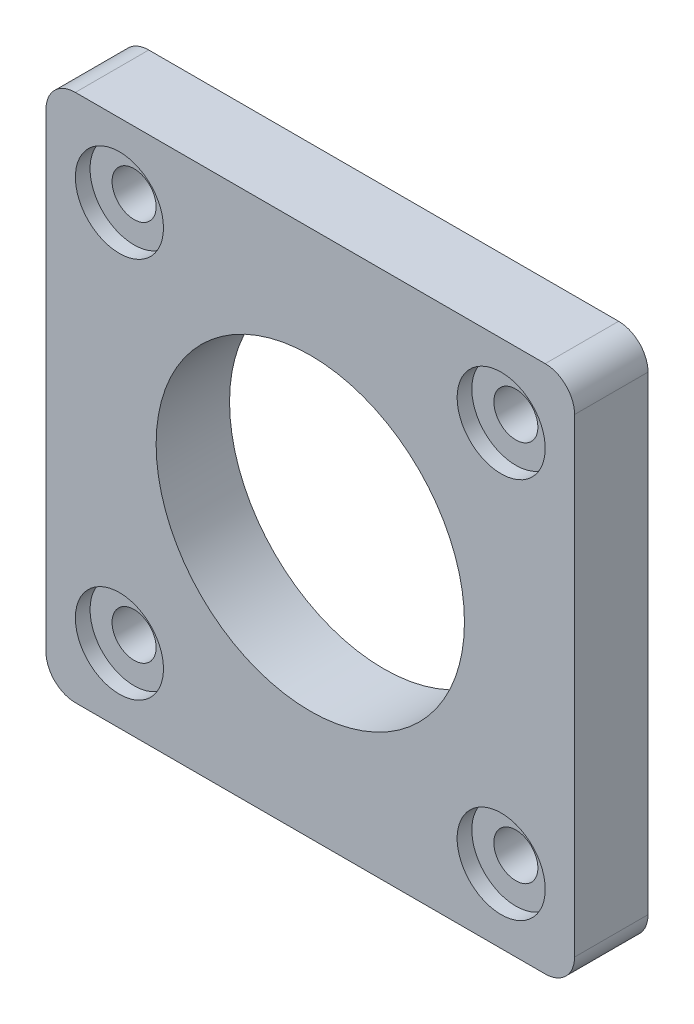
ISO-10303-21;
HEADER;
FILE_DESCRIPTION(('STEP AP214'),'2;1');
FILE_NAME('part.step','',(''),(''),'','','');
FILE_SCHEMA(('AUTOMOTIVE_DESIGN { 1 0 10303 214 1 1 1 1 }'));
ENDSEC;
DATA;
#1=APPLICATION_CONTEXT('core data for automotive mechanical design processes');
#2=APPLICATION_PROTOCOL_DEFINITION('international standard','automotive_design',2000,#1);
#3=PRODUCT_CONTEXT('',#1,'mechanical');
#4=PRODUCT('Part','Part','',(#3));
#5=PRODUCT_RELATED_PRODUCT_CATEGORY('part','',(#4));
#6=PRODUCT_DEFINITION_FORMATION('','',#4);
#7=PRODUCT_DEFINITION_CONTEXT('part definition',#1,'design');
#8=PRODUCT_DEFINITION('design','',#6,#7);
#9=PRODUCT_DEFINITION_SHAPE('','',#8);
#10=(LENGTH_UNIT() NAMED_UNIT(*) SI_UNIT(.MILLI.,.METRE.));
#11=(NAMED_UNIT(*) PLANE_ANGLE_UNIT() SI_UNIT($,.RADIAN.));
#12=(NAMED_UNIT(*) SI_UNIT($,.STERADIAN.) SOLID_ANGLE_UNIT());
#13=UNCERTAINTY_MEASURE_WITH_UNIT(LENGTH_MEASURE(1.E-05),#10,'distance_accuracy_value','');
#14=(GEOMETRIC_REPRESENTATION_CONTEXT(3) GLOBAL_UNCERTAINTY_ASSIGNED_CONTEXT((#13)) GLOBAL_UNIT_ASSIGNED_CONTEXT((#10,
#11,#12)) REPRESENTATION_CONTEXT('',''));
#15=CARTESIAN_POINT('',(0.,0.,0.));
#16=DIRECTION('',(0.,0.,1.));
#17=DIRECTION('',(1.,0.,0.));
#18=AXIS2_PLACEMENT_3D('',#15,#16,#17);
#19=CARTESIAN_POINT('',(-160.,160.,50.));
#20=DIRECTION('',(0.,0.,1.));
#21=DIRECTION('',(1.,0.,0.));
#22=AXIS2_PLACEMENT_3D('',#19,#20,#21);
#23=PLANE('',#22);
#24=CARTESIAN_POINT('',(130.,130.,50.));
#25=DIRECTION('',(0.,0.,-1.));
#26=DIRECTION('',(-1.,0.,0.));
#27=AXIS2_PLACEMENT_3D('',#24,#25,#26);
#28=CIRCLE('',#27,30.);
#29=CARTESIAN_POINT('',(100.,130.,50.));
#30=VERTEX_POINT('',#29);
#31=EDGE_CURVE('E351',#30,#30,#28,.T.);
#32=ORIENTED_EDGE('',*,*,#31,.T.);
#33=EDGE_LOOP('',(#32));
#34=FACE_BOUND('',#33,.T.);
#35=CARTESIAN_POINT('',(-130.,130.,50.));
#36=DIRECTION('',(0.,0.,1.));
#37=DIRECTION('',(1.,0.,0.));
#38=AXIS2_PLACEMENT_3D('',#35,#36,#37);
#39=CIRCLE('',#38,30.);
#40=CARTESIAN_POINT('',(-100.,130.,50.));
#41=VERTEX_POINT('',#40);
#42=EDGE_CURVE('E348',#41,#41,#39,.T.);
#43=ORIENTED_EDGE('',*,*,#42,.F.);
#44=EDGE_LOOP('',(#43));
#45=FACE_BOUND('',#44,.T.);
#46=CARTESIAN_POINT('',(0.,0.,50.));
#47=DIRECTION('',(0.,0.,1.));
#48=DIRECTION('',(1.,0.,0.));
#49=AXIS2_PLACEMENT_3D('',#46,#47,#48);
#50=CIRCLE('',#49,105.);
#51=CARTESIAN_POINT('',(105.,0.,50.));
#52=VERTEX_POINT('',#51);
#53=EDGE_CURVE('E221',#52,#52,#50,.T.);
#54=ORIENTED_EDGE('',*,*,#53,.F.);
#55=EDGE_LOOP('',(#54));
#56=FACE_BOUND('',#55,.T.);
#57=CARTESIAN_POINT('',(-160.,160.,50.));
#58=DIRECTION('',(0.,0.,1.));
#59=DIRECTION('',(1.,0.,0.));
#60=AXIS2_PLACEMENT_3D('',#57,#58,#59);
#61=CIRCLE('',#60,20.);
#62=CARTESIAN_POINT('',(-160.,180.,50.));
#63=VERTEX_POINT('',#62);
#64=CARTESIAN_POINT('',(-180.,160.,50.));
#65=VERTEX_POINT('',#64);
#66=EDGE_CURVE('E170',#63,#65,#61,.T.);
#67=ORIENTED_EDGE('',*,*,#66,.T.);
#68=DIRECTION('',(0.,-1.,0.));
#69=VECTOR('',#68,1.);
#70=CARTESIAN_POINT('',(-180.,160.,50.));
#71=LINE('',#70,#69);
#72=CARTESIAN_POINT('',(-180.,-160.,50.));
#73=VERTEX_POINT('',#72);
#74=EDGE_CURVE('E97',#65,#73,#71,.T.);
#75=ORIENTED_EDGE('',*,*,#74,.T.);
#76=CARTESIAN_POINT('',(-160.,-160.,50.));
#77=DIRECTION('',(0.,0.,1.));
#78=DIRECTION('',(1.,0.,0.));
#79=AXIS2_PLACEMENT_3D('',#76,#77,#78);
#80=CIRCLE('',#79,20.);
#81=CARTESIAN_POINT('',(-160.,-180.,50.));
#82=VERTEX_POINT('',#81);
#83=EDGE_CURVE('E232',#73,#82,#80,.T.);
#84=ORIENTED_EDGE('',*,*,#83,.T.);
#85=DIRECTION('',(1.,0.,0.));
#86=VECTOR('',#85,1.);
#87=CARTESIAN_POINT('',(-160.,-180.,50.));
#88=LINE('',#87,#86);
#89=CARTESIAN_POINT('',(160.,-180.,50.));
#90=VERTEX_POINT('',#89);
#91=EDGE_CURVE('E235',#82,#90,#88,.T.);
#92=ORIENTED_EDGE('',*,*,#91,.T.);
#93=CARTESIAN_POINT('',(160.,-160.,50.));
#94=DIRECTION('',(0.,0.,-1.));
#95=DIRECTION('',(-1.,0.,0.));
#96=AXIS2_PLACEMENT_3D('',#93,#94,#95);
#97=CIRCLE('',#96,20.);
#98=CARTESIAN_POINT('',(180.,-160.,50.));
#99=VERTEX_POINT('',#98);
#100=EDGE_CURVE('E132',#99,#90,#97,.T.);
#101=ORIENTED_EDGE('',*,*,#100,.F.);
#102=DIRECTION('',(0.,-1.,0.));
#103=VECTOR('',#102,1.);
#104=CARTESIAN_POINT('',(180.,160.,50.));
#105=LINE('',#104,#103);
#106=CARTESIAN_POINT('',(180.,160.,50.));
#107=VERTEX_POINT('',#106);
#108=EDGE_CURVE('E116',#107,#99,#105,.T.);
#109=ORIENTED_EDGE('',*,*,#108,.F.);
#110=CARTESIAN_POINT('',(160.,160.,50.));
#111=DIRECTION('',(0.,0.,-1.));
#112=DIRECTION('',(-1.,0.,0.));
#113=AXIS2_PLACEMENT_3D('',#110,#111,#112);
#114=CIRCLE('',#113,20.);
#115=CARTESIAN_POINT('',(160.,180.,50.));
#116=VERTEX_POINT('',#115);
#117=EDGE_CURVE('E130',#116,#107,#114,.T.);
#118=ORIENTED_EDGE('',*,*,#117,.F.);
#119=DIRECTION('',(1.,0.,0.));
#120=VECTOR('',#119,1.);
#121=CARTESIAN_POINT('',(-160.,180.,50.));
#122=LINE('',#121,#120);
#123=EDGE_CURVE('E137',#63,#116,#122,.T.);
#124=ORIENTED_EDGE('',*,*,#123,.F.);
#125=EDGE_LOOP('',(#67,#75,#84,#92,#101,#109,#118,#124));
#126=FACE_BOUND('',#125,.T.);
#127=CARTESIAN_POINT('',(130.,-130.,50.));
#128=DIRECTION('',(0.,0.,1.));
#129=DIRECTION('',(1.,0.,0.));
#130=AXIS2_PLACEMENT_3D('',#127,#128,#129);
#131=CIRCLE('',#130,30.);
#132=CARTESIAN_POINT('',(160.,-130.,50.));
#133=VERTEX_POINT('',#132);
#134=EDGE_CURVE('E365',#133,#133,#131,.T.);
#135=ORIENTED_EDGE('',*,*,#134,.F.);
#136=EDGE_LOOP('',(#135));
#137=FACE_BOUND('',#136,.T.);
#138=CARTESIAN_POINT('',(-130.,-130.,50.));
#139=DIRECTION('',(0.,0.,-1.));
#140=DIRECTION('',(-1.,0.,0.));
#141=AXIS2_PLACEMENT_3D('',#138,#139,#140);
#142=CIRCLE('',#141,30.);
#143=CARTESIAN_POINT('',(-160.,-130.,50.));
#144=VERTEX_POINT('',#143);
#145=EDGE_CURVE('E337',#144,#144,#142,.T.);
#146=ORIENTED_EDGE('',*,*,#145,.T.);
#147=EDGE_LOOP('',(#146));
#148=FACE_BOUND('',#147,.T.);
#149=ADVANCED_FACE('F39',(#34,#45,#56,#126,#137,#148),#23,.T.);
#150=CARTESIAN_POINT('',(-130.,130.,0.));
#151=DIRECTION('',(0.,0.,1.));
#152=DIRECTION('',(1.,0.,0.));
#153=AXIS2_PLACEMENT_3D('',#150,#151,#152);
#154=CYLINDRICAL_SURFACE('',#153,15.);
#155=CARTESIAN_POINT('',(-130.,130.,0.));
#156=DIRECTION('',(0.,0.,1.));
#157=DIRECTION('',(1.,0.,0.));
#158=AXIS2_PLACEMENT_3D('',#155,#156,#157);
#159=CIRCLE('',#158,15.);
#160=CARTESIAN_POINT('',(-115.,130.,0.));
#161=VERTEX_POINT('',#160);
#162=EDGE_CURVE('E217',#161,#161,#159,.T.);
#163=ORIENTED_EDGE('',*,*,#162,.F.);
#164=EDGE_LOOP('',(#163));
#165=FACE_BOUND('',#164,.T.);
#166=CARTESIAN_POINT('',(-130.,130.,40.));
#167=DIRECTION('',(0.,0.,1.));
#168=DIRECTION('',(1.,0.,0.));
#169=AXIS2_PLACEMENT_3D('',#166,#167,#168);
#170=CIRCLE('',#169,15.);
#171=CARTESIAN_POINT('',(-115.,130.,40.));
#172=VERTEX_POINT('',#171);
#173=EDGE_CURVE('E43',#172,#172,#170,.F.);
#174=ORIENTED_EDGE('',*,*,#173,.F.);
#175=EDGE_LOOP('',(#174));
#176=FACE_BOUND('',#175,.T.);
#177=ADVANCED_FACE('F260',(#165,#176),#154,.F.);
#178=CARTESIAN_POINT('',(130.,-130.,0.));
#179=DIRECTION('',(0.,0.,1.));
#180=DIRECTION('',(1.,0.,0.));
#181=AXIS2_PLACEMENT_3D('',#178,#179,#180);
#182=CYLINDRICAL_SURFACE('',#181,15.);
#183=CARTESIAN_POINT('',(130.,-130.,0.));
#184=DIRECTION('',(0.,0.,1.));
#185=DIRECTION('',(1.,0.,0.));
#186=AXIS2_PLACEMENT_3D('',#183,#184,#185);
#187=CIRCLE('',#186,15.);
#188=CARTESIAN_POINT('',(145.,-130.,0.));
#189=VERTEX_POINT('',#188);
#190=EDGE_CURVE('E207',#189,#189,#187,.T.);
#191=ORIENTED_EDGE('',*,*,#190,.F.);
#192=EDGE_LOOP('',(#191));
#193=FACE_BOUND('',#192,.T.);
#194=CARTESIAN_POINT('',(130.,-130.,40.));
#195=DIRECTION('',(0.,0.,1.));
#196=DIRECTION('',(1.,0.,0.));
#197=AXIS2_PLACEMENT_3D('',#194,#195,#196);
#198=CIRCLE('',#197,15.);
#199=CARTESIAN_POINT('',(145.,-130.,40.));
#200=VERTEX_POINT('',#199);
#201=EDGE_CURVE('E191',#200,#200,#198,.F.);
#202=ORIENTED_EDGE('',*,*,#201,.F.);
#203=EDGE_LOOP('',(#202));
#204=FACE_BOUND('',#203,.T.);
#205=ADVANCED_FACE('F266',(#193,#204),#182,.F.);
#206=CARTESIAN_POINT('',(-160.,160.,0.));
#207=DIRECTION('',(0.,0.,1.));
#208=DIRECTION('',(1.,0.,0.));
#209=AXIS2_PLACEMENT_3D('',#206,#207,#208);
#210=PLANE('',#209);
#211=ORIENTED_EDGE('',*,*,#190,.T.);
#212=EDGE_LOOP('',(#211));
#213=FACE_BOUND('',#212,.T.);
#214=ORIENTED_EDGE('',*,*,#162,.T.);
#215=EDGE_LOOP('',(#214));
#216=FACE_BOUND('',#215,.T.);
#217=CARTESIAN_POINT('',(0.,0.,0.));
#218=DIRECTION('',(0.,0.,1.));
#219=DIRECTION('',(1.,0.,0.));
#220=AXIS2_PLACEMENT_3D('',#217,#218,#219);
#221=CIRCLE('',#220,105.);
#222=CARTESIAN_POINT('',(105.,0.,0.));
#223=VERTEX_POINT('',#222);
#224=EDGE_CURVE('E147',#223,#223,#221,.T.);
#225=ORIENTED_EDGE('',*,*,#224,.T.);
#226=EDGE_LOOP('',(#225));
#227=FACE_BOUND('',#226,.T.);
#228=CARTESIAN_POINT('',(-160.,160.,0.));
#229=DIRECTION('',(0.,0.,1.));
#230=DIRECTION('',(1.,0.,0.));
#231=AXIS2_PLACEMENT_3D('',#228,#229,#230);
#232=CIRCLE('',#231,20.);
#233=CARTESIAN_POINT('',(-160.,180.,0.));
#234=VERTEX_POINT('',#233);
#235=CARTESIAN_POINT('',(-180.,160.,0.));
#236=VERTEX_POINT('',#235);
#237=EDGE_CURVE('E143',#234,#236,#232,.T.);
#238=ORIENTED_EDGE('',*,*,#237,.F.);
#239=DIRECTION('',(1.,0.,0.));
#240=VECTOR('',#239,1.);
#241=CARTESIAN_POINT('',(-160.,180.,0.));
#242=LINE('',#241,#240);
#243=CARTESIAN_POINT('',(160.,180.,0.));
#244=VERTEX_POINT('',#243);
#245=EDGE_CURVE('E166',#234,#244,#242,.T.);
#246=ORIENTED_EDGE('',*,*,#245,.T.);
#247=CARTESIAN_POINT('',(160.,160.,0.));
#248=DIRECTION('',(0.,0.,-1.));
#249=DIRECTION('',(-1.,0.,0.));
#250=AXIS2_PLACEMENT_3D('',#247,#248,#249);
#251=CIRCLE('',#250,20.);
#252=CARTESIAN_POINT('',(180.,160.,0.));
#253=VERTEX_POINT('',#252);
#254=EDGE_CURVE('E163',#244,#253,#251,.T.);
#255=ORIENTED_EDGE('',*,*,#254,.T.);
#256=DIRECTION('',(0.,-1.,0.));
#257=VECTOR('',#256,1.);
#258=CARTESIAN_POINT('',(180.,160.,0.));
#259=LINE('',#258,#257);
#260=CARTESIAN_POINT('',(180.,-160.,0.));
#261=VERTEX_POINT('',#260);
#262=EDGE_CURVE('E118',#253,#261,#259,.T.);
#263=ORIENTED_EDGE('',*,*,#262,.T.);
#264=CARTESIAN_POINT('',(160.,-160.,0.));
#265=DIRECTION('',(0.,0.,-1.));
#266=DIRECTION('',(-1.,0.,0.));
#267=AXIS2_PLACEMENT_3D('',#264,#265,#266);
#268=CIRCLE('',#267,20.);
#269=CARTESIAN_POINT('',(160.,-180.,0.));
#270=VERTEX_POINT('',#269);
#271=EDGE_CURVE('E157',#261,#270,#268,.T.);
#272=ORIENTED_EDGE('',*,*,#271,.T.);
#273=DIRECTION('',(1.,0.,0.));
#274=VECTOR('',#273,1.);
#275=CARTESIAN_POINT('',(-160.,-180.,0.));
#276=LINE('',#275,#274);
#277=CARTESIAN_POINT('',(-160.,-180.,0.));
#278=VERTEX_POINT('',#277);
#279=EDGE_CURVE('E153',#278,#270,#276,.T.);
#280=ORIENTED_EDGE('',*,*,#279,.F.);
#281=CARTESIAN_POINT('',(-160.,-160.,0.));
#282=DIRECTION('',(0.,0.,1.));
#283=DIRECTION('',(1.,0.,0.));
#284=AXIS2_PLACEMENT_3D('',#281,#282,#283);
#285=CIRCLE('',#284,20.);
#286=CARTESIAN_POINT('',(-180.,-160.,0.));
#287=VERTEX_POINT('',#286);
#288=EDGE_CURVE('E150',#287,#278,#285,.T.);
#289=ORIENTED_EDGE('',*,*,#288,.F.);
#290=DIRECTION('',(0.,-1.,0.));
#291=VECTOR('',#290,1.);
#292=CARTESIAN_POINT('',(-180.,160.,0.));
#293=LINE('',#292,#291);
#294=EDGE_CURVE('E146',#236,#287,#293,.T.);
#295=ORIENTED_EDGE('',*,*,#294,.F.);
#296=EDGE_LOOP('',(#238,#246,#255,#263,#272,#280,#289,#295));
#297=FACE_BOUND('',#296,.T.);
#298=CARTESIAN_POINT('',(130.,130.,0.));
#299=DIRECTION('',(0.,0.,-1.));
#300=DIRECTION('',(-1.,0.,0.));
#301=AXIS2_PLACEMENT_3D('',#298,#299,#300);
#302=CIRCLE('',#301,15.);
#303=CARTESIAN_POINT('',(115.,130.,0.));
#304=VERTEX_POINT('',#303);
#305=EDGE_CURVE('E213',#304,#304,#302,.T.);
#306=ORIENTED_EDGE('',*,*,#305,.F.);
#307=EDGE_LOOP('',(#306));
#308=FACE_BOUND('',#307,.T.);
#309=CARTESIAN_POINT('',(-130.,-130.,0.));
#310=DIRECTION('',(0.,0.,-1.));
#311=DIRECTION('',(-1.,0.,0.));
#312=AXIS2_PLACEMENT_3D('',#309,#310,#311);
#313=CIRCLE('',#312,15.);
#314=CARTESIAN_POINT('',(-145.,-130.,0.));
#315=VERTEX_POINT('',#314);
#316=EDGE_CURVE('E202',#315,#315,#313,.T.);
#317=ORIENTED_EDGE('',*,*,#316,.F.);
#318=EDGE_LOOP('',(#317));
#319=FACE_BOUND('',#318,.T.);
#320=ADVANCED_FACE('F244',(#213,#216,#227,#297,#308,#319),#210,.F.);
#321=CARTESIAN_POINT('',(-160.,160.,50.));
#322=DIRECTION('',(0.,0.,-1.));
#323=DIRECTION('',(-1.,0.,0.));
#324=AXIS2_PLACEMENT_3D('',#321,#322,#323);
#325=CYLINDRICAL_SURFACE('',#324,20.);
#326=ORIENTED_EDGE('',*,*,#237,.T.);
#327=DIRECTION('',(0.,0.,-1.));
#328=VECTOR('',#327,1.);
#329=CARTESIAN_POINT('',(-180.,160.,50.));
#330=LINE('',#329,#328);
#331=EDGE_CURVE('E11',#65,#236,#330,.T.);
#332=ORIENTED_EDGE('',*,*,#331,.F.);
#333=ORIENTED_EDGE('',*,*,#66,.F.);
#334=DIRECTION('',(0.,0.,-1.));
#335=VECTOR('',#334,1.);
#336=CARTESIAN_POINT('',(-160.,180.,50.));
#337=LINE('',#336,#335);
#338=EDGE_CURVE('E59',#63,#234,#337,.T.);
#339=ORIENTED_EDGE('',*,*,#338,.T.);
#340=EDGE_LOOP('',(#326,#332,#333,#339));
#341=FACE_BOUND('',#340,.T.);
#342=ADVANCED_FACE('F41',(#341),#325,.T.);
#343=CARTESIAN_POINT('',(-180.,160.,50.));
#344=DIRECTION('',(1.,0.,0.));
#345=DIRECTION('',(0.,1.,0.));
#346=AXIS2_PLACEMENT_3D('',#343,#344,#345);
#347=PLANE('',#346);
#348=ORIENTED_EDGE('',*,*,#294,.T.);
#349=DIRECTION('',(0.,0.,-1.));
#350=VECTOR('',#349,1.);
#351=CARTESIAN_POINT('',(-180.,-160.,50.));
#352=LINE('',#351,#350);
#353=EDGE_CURVE('E50',#73,#287,#352,.T.);
#354=ORIENTED_EDGE('',*,*,#353,.F.);
#355=ORIENTED_EDGE('',*,*,#74,.F.);
#356=ORIENTED_EDGE('',*,*,#331,.T.);
#357=EDGE_LOOP('',(#348,#354,#355,#356));
#358=FACE_BOUND('',#357,.T.);
#359=ADVANCED_FACE('F277',(#358),#347,.F.);
#360=CARTESIAN_POINT('',(-160.,-160.,50.));
#361=DIRECTION('',(0.,0.,-1.));
#362=DIRECTION('',(-1.,0.,0.));
#363=AXIS2_PLACEMENT_3D('',#360,#361,#362);
#364=CYLINDRICAL_SURFACE('',#363,20.);
#365=ORIENTED_EDGE('',*,*,#288,.T.);
#366=DIRECTION('',(0.,0.,-1.));
#367=VECTOR('',#366,1.);
#368=CARTESIAN_POINT('',(-160.,-180.,50.));
#369=LINE('',#368,#367);
#370=EDGE_CURVE('E180',#82,#278,#369,.T.);
#371=ORIENTED_EDGE('',*,*,#370,.F.);
#372=ORIENTED_EDGE('',*,*,#83,.F.);
#373=ORIENTED_EDGE('',*,*,#353,.T.);
#374=EDGE_LOOP('',(#365,#371,#372,#373));
#375=FACE_BOUND('',#374,.T.);
#376=ADVANCED_FACE('F480',(#375),#364,.T.);
#377=CARTESIAN_POINT('',(-160.,-180.,50.));
#378=DIRECTION('',(0.,1.,0.));
#379=DIRECTION('',(-1.,0.,0.));
#380=AXIS2_PLACEMENT_3D('',#377,#378,#379);
#381=PLANE('',#380);
#382=ORIENTED_EDGE('',*,*,#279,.T.);
#383=DIRECTION('',(0.,0.,-1.));
#384=VECTOR('',#383,1.);
#385=CARTESIAN_POINT('',(160.,-180.,50.));
#386=LINE('',#385,#384);
#387=EDGE_CURVE('E177',#90,#270,#386,.T.);
#388=ORIENTED_EDGE('',*,*,#387,.F.);
#389=ORIENTED_EDGE('',*,*,#91,.F.);
#390=ORIENTED_EDGE('',*,*,#370,.T.);
#391=EDGE_LOOP('',(#382,#388,#389,#390));
#392=FACE_BOUND('',#391,.T.);
#393=ADVANCED_FACE('F471',(#392),#381,.F.);
#394=CARTESIAN_POINT('',(160.,-160.,50.));
#395=DIRECTION('',(0.,0.,-1.));
#396=DIRECTION('',(-1.,0.,0.));
#397=AXIS2_PLACEMENT_3D('',#394,#395,#396);
#398=CYLINDRICAL_SURFACE('',#397,20.);
#399=ORIENTED_EDGE('',*,*,#271,.F.);
#400=DIRECTION('',(0.,0.,-1.));
#401=VECTOR('',#400,1.);
#402=CARTESIAN_POINT('',(180.,-160.,50.));
#403=LINE('',#402,#401);
#404=EDGE_CURVE('E123',#99,#261,#403,.T.);
#405=ORIENTED_EDGE('',*,*,#404,.F.);
#406=ORIENTED_EDGE('',*,*,#100,.T.);
#407=ORIENTED_EDGE('',*,*,#387,.T.);
#408=EDGE_LOOP('',(#399,#405,#406,#407));
#409=FACE_BOUND('',#408,.T.);
#410=ADVANCED_FACE('F240',(#409),#398,.T.);
#411=CARTESIAN_POINT('',(180.,160.,50.));
#412=DIRECTION('',(1.,0.,0.));
#413=DIRECTION('',(0.,1.,0.));
#414=AXIS2_PLACEMENT_3D('',#411,#412,#413);
#415=PLANE('',#414);
#416=ORIENTED_EDGE('',*,*,#262,.F.);
#417=DIRECTION('',(0.,0.,-1.));
#418=VECTOR('',#417,1.);
#419=CARTESIAN_POINT('',(180.,160.,50.));
#420=LINE('',#419,#418);
#421=EDGE_CURVE('E113',#107,#253,#420,.T.);
#422=ORIENTED_EDGE('',*,*,#421,.F.);
#423=ORIENTED_EDGE('',*,*,#108,.T.);
#424=ORIENTED_EDGE('',*,*,#404,.T.);
#425=EDGE_LOOP('',(#416,#422,#423,#424));
#426=FACE_BOUND('',#425,.T.);
#427=ADVANCED_FACE('F115',(#426),#415,.T.);
#428=CARTESIAN_POINT('',(160.,160.,50.));
#429=DIRECTION('',(0.,0.,-1.));
#430=DIRECTION('',(-1.,0.,0.));
#431=AXIS2_PLACEMENT_3D('',#428,#429,#430);
#432=CYLINDRICAL_SURFACE('',#431,20.);
#433=ORIENTED_EDGE('',*,*,#254,.F.);
#434=DIRECTION('',(0.,0.,-1.));
#435=VECTOR('',#434,1.);
#436=CARTESIAN_POINT('',(160.,180.,50.));
#437=LINE('',#436,#435);
#438=EDGE_CURVE('E85',#116,#244,#437,.T.);
#439=ORIENTED_EDGE('',*,*,#438,.F.);
#440=ORIENTED_EDGE('',*,*,#117,.T.);
#441=ORIENTED_EDGE('',*,*,#421,.T.);
#442=EDGE_LOOP('',(#433,#439,#440,#441));
#443=FACE_BOUND('',#442,.T.);
#444=ADVANCED_FACE('F135',(#443),#432,.T.);
#445=CARTESIAN_POINT('',(-160.,180.,50.));
#446=DIRECTION('',(0.,1.,0.));
#447=DIRECTION('',(0.,0.,1.));
#448=AXIS2_PLACEMENT_3D('',#445,#446,#447);
#449=PLANE('',#448);
#450=ORIENTED_EDGE('',*,*,#245,.F.);
#451=ORIENTED_EDGE('',*,*,#338,.F.);
#452=ORIENTED_EDGE('',*,*,#123,.T.);
#453=ORIENTED_EDGE('',*,*,#438,.T.);
#454=EDGE_LOOP('',(#450,#451,#452,#453));
#455=FACE_BOUND('',#454,.T.);
#456=ADVANCED_FACE('F246',(#455),#449,.T.);
#457=CARTESIAN_POINT('',(0.,0.,0.));
#458=DIRECTION('',(0.,0.,1.));
#459=DIRECTION('',(1.,0.,0.));
#460=AXIS2_PLACEMENT_3D('',#457,#458,#459);
#461=CYLINDRICAL_SURFACE('',#460,105.);
#462=ORIENTED_EDGE('',*,*,#224,.F.);
#463=EDGE_LOOP('',(#462));
#464=FACE_BOUND('',#463,.T.);
#465=ORIENTED_EDGE('',*,*,#53,.T.);
#466=EDGE_LOOP('',(#465));
#467=FACE_BOUND('',#466,.T.);
#468=ADVANCED_FACE('F248',(#464,#467),#461,.F.);
#469=CARTESIAN_POINT('',(130.,130.,0.));
#470=DIRECTION('',(0.,0.,1.));
#471=DIRECTION('',(1.,0.,0.));
#472=AXIS2_PLACEMENT_3D('',#469,#470,#471);
#473=CYLINDRICAL_SURFACE('',#472,15.);
#474=CARTESIAN_POINT('',(130.,130.,40.));
#475=DIRECTION('',(0.,0.,-1.));
#476=DIRECTION('',(-1.,0.,0.));
#477=AXIS2_PLACEMENT_3D('',#474,#475,#476);
#478=CIRCLE('',#477,15.);
#479=CARTESIAN_POINT('',(115.,130.,40.));
#480=VERTEX_POINT('',#479);
#481=EDGE_CURVE('E195',#480,#480,#478,.T.);
#482=ORIENTED_EDGE('',*,*,#481,.F.);
#483=EDGE_LOOP('',(#482));
#484=FACE_BOUND('',#483,.T.);
#485=ORIENTED_EDGE('',*,*,#305,.T.);
#486=EDGE_LOOP('',(#485));
#487=FACE_BOUND('',#486,.T.);
#488=ADVANCED_FACE('F254',(#484,#487),#473,.F.);
#489=CARTESIAN_POINT('',(-130.,-130.,0.));
#490=DIRECTION('',(0.,0.,1.));
#491=DIRECTION('',(1.,0.,0.));
#492=AXIS2_PLACEMENT_3D('',#489,#490,#491);
#493=CYLINDRICAL_SURFACE('',#492,15.);
#494=CARTESIAN_POINT('',(-130.,-130.,40.));
#495=DIRECTION('',(0.,0.,-1.));
#496=DIRECTION('',(-1.,0.,0.));
#497=AXIS2_PLACEMENT_3D('',#494,#495,#496);
#498=CIRCLE('',#497,15.);
#499=CARTESIAN_POINT('',(-145.,-130.,40.));
#500=VERTEX_POINT('',#499);
#501=EDGE_CURVE('E187',#500,#500,#498,.T.);
#502=ORIENTED_EDGE('',*,*,#501,.F.);
#503=EDGE_LOOP('',(#502));
#504=FACE_BOUND('',#503,.T.);
#505=ORIENTED_EDGE('',*,*,#316,.T.);
#506=EDGE_LOOP('',(#505));
#507=FACE_BOUND('',#506,.T.);
#508=ADVANCED_FACE('F312',(#504,#507),#493,.F.);
#509=CARTESIAN_POINT('',(-130.,-130.,40.));
#510=DIRECTION('',(0.,0.,1.));
#511=DIRECTION('',(1.,0.,0.));
#512=AXIS2_PLACEMENT_3D('',#509,#510,#511);
#513=CYLINDRICAL_SURFACE('',#512,30.);
#514=CARTESIAN_POINT('',(-130.,-130.,40.));
#515=DIRECTION('',(0.,0.,-1.));
#516=DIRECTION('',(-1.,0.,0.));
#517=AXIS2_PLACEMENT_3D('',#514,#515,#516);
#518=CIRCLE('',#517,30.);
#519=CARTESIAN_POINT('',(-160.,-130.,40.));
#520=VERTEX_POINT('',#519);
#521=EDGE_CURVE('E335',#520,#520,#518,.T.);
#522=ORIENTED_EDGE('',*,*,#521,.T.);
#523=EDGE_LOOP('',(#522));
#524=FACE_BOUND('',#523,.T.);
#525=ORIENTED_EDGE('',*,*,#145,.F.);
#526=EDGE_LOOP('',(#525));
#527=FACE_BOUND('',#526,.T.);
#528=ADVANCED_FACE('F305',(#524,#527),#513,.F.);
#529=CARTESIAN_POINT('',(-130.,-130.,40.));
#530=DIRECTION('',(0.,0.,-1.));
#531=DIRECTION('',(-1.,0.,0.));
#532=AXIS2_PLACEMENT_3D('',#529,#530,#531);
#533=PLANE('',#532);
#534=ORIENTED_EDGE('',*,*,#501,.T.);
#535=EDGE_LOOP('',(#534));
#536=FACE_BOUND('',#535,.T.);
#537=ORIENTED_EDGE('',*,*,#521,.F.);
#538=EDGE_LOOP('',(#537));
#539=FACE_BOUND('',#538,.T.);
#540=ADVANCED_FACE('F295',(#536,#539),#533,.F.);
#541=CARTESIAN_POINT('',(130.,-130.,40.));
#542=DIRECTION('',(0.,0.,1.));
#543=DIRECTION('',(1.,0.,0.));
#544=AXIS2_PLACEMENT_3D('',#541,#542,#543);
#545=PLANE('',#544);
#546=CARTESIAN_POINT('',(130.,-130.,40.));
#547=DIRECTION('',(0.,0.,1.));
#548=DIRECTION('',(1.,0.,0.));
#549=AXIS2_PLACEMENT_3D('',#546,#547,#548);
#550=CIRCLE('',#549,30.);
#551=CARTESIAN_POINT('',(160.,-130.,40.));
#552=VERTEX_POINT('',#551);
#553=EDGE_CURVE('E341',#552,#552,#550,.T.);
#554=ORIENTED_EDGE('',*,*,#553,.T.);
#555=EDGE_LOOP('',(#554));
#556=FACE_BOUND('',#555,.T.);
#557=ORIENTED_EDGE('',*,*,#201,.T.);
#558=EDGE_LOOP('',(#557));
#559=FACE_BOUND('',#558,.T.);
#560=ADVANCED_FACE('F292',(#556,#559),#545,.T.);
#561=CARTESIAN_POINT('',(130.,-130.,40.));
#562=DIRECTION('',(0.,0.,1.));
#563=DIRECTION('',(1.,0.,0.));
#564=AXIS2_PLACEMENT_3D('',#561,#562,#563);
#565=CYLINDRICAL_SURFACE('',#564,30.);
#566=ORIENTED_EDGE('',*,*,#553,.F.);
#567=EDGE_LOOP('',(#566));
#568=FACE_BOUND('',#567,.T.);
#569=ORIENTED_EDGE('',*,*,#134,.T.);
#570=EDGE_LOOP('',(#569));
#571=FACE_BOUND('',#570,.T.);
#572=ADVANCED_FACE('F294',(#568,#571),#565,.F.);
#573=CARTESIAN_POINT('',(130.,130.,40.));
#574=DIRECTION('',(0.,0.,1.));
#575=DIRECTION('',(1.,0.,0.));
#576=AXIS2_PLACEMENT_3D('',#573,#574,#575);
#577=CYLINDRICAL_SURFACE('',#576,30.);
#578=CARTESIAN_POINT('',(130.,130.,40.));
#579=DIRECTION('',(0.,0.,-1.));
#580=DIRECTION('',(-1.,0.,0.));
#581=AXIS2_PLACEMENT_3D('',#578,#579,#580);
#582=CIRCLE('',#581,30.);
#583=CARTESIAN_POINT('',(100.,130.,40.));
#584=VERTEX_POINT('',#583);
#585=EDGE_CURVE('E360',#584,#584,#582,.T.);
#586=ORIENTED_EDGE('',*,*,#585,.T.);
#587=EDGE_LOOP('',(#586));
#588=FACE_BOUND('',#587,.T.);
#589=ORIENTED_EDGE('',*,*,#31,.F.);
#590=EDGE_LOOP('',(#589));
#591=FACE_BOUND('',#590,.T.);
#592=ADVANCED_FACE('F302',(#588,#591),#577,.F.);
#593=CARTESIAN_POINT('',(130.,130.,40.));
#594=DIRECTION('',(0.,0.,-1.));
#595=DIRECTION('',(-1.,0.,0.));
#596=AXIS2_PLACEMENT_3D('',#593,#594,#595);
#597=PLANE('',#596);
#598=ORIENTED_EDGE('',*,*,#481,.T.);
#599=EDGE_LOOP('',(#598));
#600=FACE_BOUND('',#599,.T.);
#601=ORIENTED_EDGE('',*,*,#585,.F.);
#602=EDGE_LOOP('',(#601));
#603=FACE_BOUND('',#602,.T.);
#604=ADVANCED_FACE('F319',(#600,#603),#597,.F.);
#605=CARTESIAN_POINT('',(-130.,130.,40.));
#606=DIRECTION('',(0.,0.,1.));
#607=DIRECTION('',(1.,0.,0.));
#608=AXIS2_PLACEMENT_3D('',#605,#606,#607);
#609=PLANE('',#608);
#610=CARTESIAN_POINT('',(-130.,130.,40.));
#611=DIRECTION('',(0.,0.,1.));
#612=DIRECTION('',(1.,0.,0.));
#613=AXIS2_PLACEMENT_3D('',#610,#611,#612);
#614=CIRCLE('',#613,30.);
#615=CARTESIAN_POINT('',(-100.,130.,40.));
#616=VERTEX_POINT('',#615);
#617=EDGE_CURVE('E192',#616,#616,#614,.T.);
#618=ORIENTED_EDGE('',*,*,#617,.T.);
#619=EDGE_LOOP('',(#618));
#620=FACE_BOUND('',#619,.T.);
#621=ORIENTED_EDGE('',*,*,#173,.T.);
#622=EDGE_LOOP('',(#621));
#623=FACE_BOUND('',#622,.T.);
#624=ADVANCED_FACE('F315',(#620,#623),#609,.T.);
#625=CARTESIAN_POINT('',(-130.,130.,40.));
#626=DIRECTION('',(0.,0.,1.));
#627=DIRECTION('',(1.,0.,0.));
#628=AXIS2_PLACEMENT_3D('',#625,#626,#627);
#629=CYLINDRICAL_SURFACE('',#628,30.);
#630=ORIENTED_EDGE('',*,*,#617,.F.);
#631=EDGE_LOOP('',(#630));
#632=FACE_BOUND('',#631,.T.);
#633=ORIENTED_EDGE('',*,*,#42,.T.);
#634=EDGE_LOOP('',(#633));
#635=FACE_BOUND('',#634,.T.);
#636=ADVANCED_FACE('F318',(#632,#635),#629,.F.);
#637=CLOSED_SHELL('',(#149,#177,#205,#320,#342,#359,#376,#393,#410,#427,#444,#456,#468,#488,
#508,#528,#540,#560,#572,#592,#604,#624,#636));
#638=MANIFOLD_SOLID_BREP('B2',#637);
#639=ADVANCED_BREP_SHAPE_REPRESENTATION('',(#18,#638),#14);
#640=SHAPE_DEFINITION_REPRESENTATION(#9,#639);
ENDSEC;
END-ISO-10303-21;
